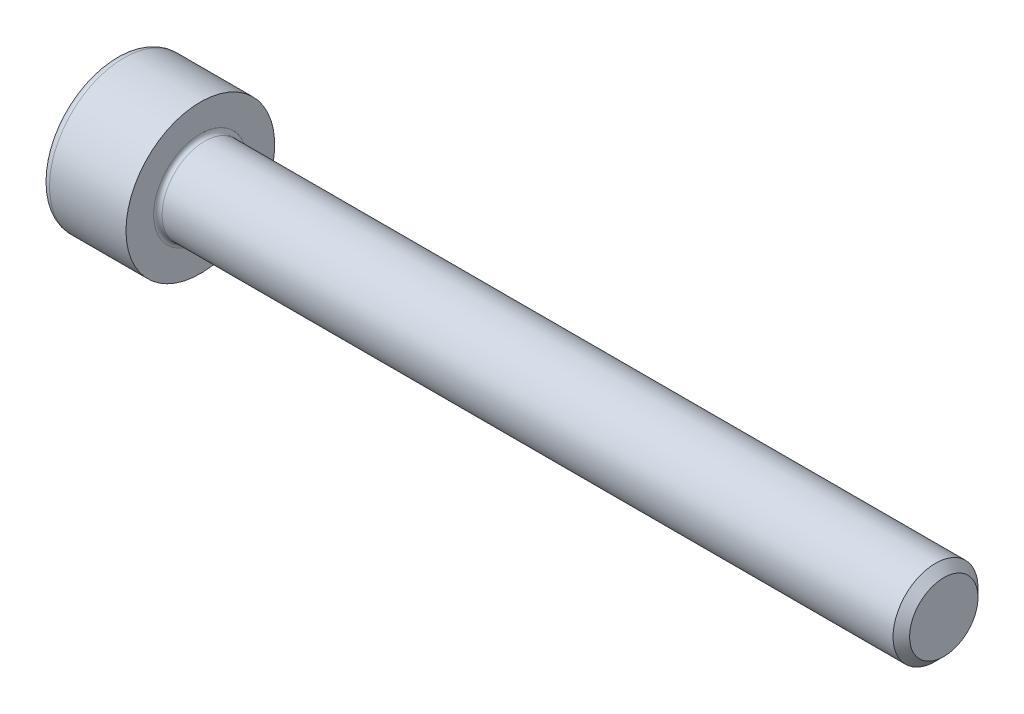
ISO-10303-21;
HEADER;
FILE_DESCRIPTION(('STEP AP214'),'2;1');
FILE_NAME('part.step','',(''),(''),'','','');
FILE_SCHEMA(('AUTOMOTIVE_DESIGN { 1 0 10303 214 1 1 1 1 }'));
ENDSEC;
DATA;
#1=APPLICATION_CONTEXT('core data for automotive mechanical design processes');
#2=APPLICATION_PROTOCOL_DEFINITION('international standard','automotive_design',2000,#1);
#3=PRODUCT_CONTEXT('',#1,'mechanical');
#4=PRODUCT('Part','Part','',(#3));
#5=PRODUCT_RELATED_PRODUCT_CATEGORY('part','',(#4));
#6=PRODUCT_DEFINITION_FORMATION('','',#4);
#7=PRODUCT_DEFINITION_CONTEXT('part definition',#1,'design');
#8=PRODUCT_DEFINITION('design','',#6,#7);
#9=PRODUCT_DEFINITION_SHAPE('','',#8);
#10=(LENGTH_UNIT() NAMED_UNIT(*) SI_UNIT(.MILLI.,.METRE.));
#11=(NAMED_UNIT(*) PLANE_ANGLE_UNIT() SI_UNIT($,.RADIAN.));
#12=(NAMED_UNIT(*) SI_UNIT($,.STERADIAN.) SOLID_ANGLE_UNIT());
#13=UNCERTAINTY_MEASURE_WITH_UNIT(LENGTH_MEASURE(1.E-05),#10,'distance_accuracy_value','');
#14=(GEOMETRIC_REPRESENTATION_CONTEXT(3) GLOBAL_UNCERTAINTY_ASSIGNED_CONTEXT((#13)) GLOBAL_UNIT_ASSIGNED_CONTEXT((#10,
#11,#12)) REPRESENTATION_CONTEXT('',''));
#15=CARTESIAN_POINT('',(0.,0.,0.));
#16=DIRECTION('',(0.,0.,1.));
#17=DIRECTION('',(1.,0.,0.));
#18=AXIS2_PLACEMENT_3D('',#15,#16,#17);
#19=CARTESIAN_POINT('',(0.,0.,0.));
#20=DIRECTION('',(-1.,0.,0.));
#21=DIRECTION('',(0.,0.,1.));
#22=AXIS2_PLACEMENT_3D('',#19,#20,#21);
#23=PLANE('',#22);
#24=DIRECTION('',(0.,-0.499999999999999,0.866025403784439));
#25=VECTOR('',#24,1.);
#26=CARTESIAN_POINT('',(0.,1.74359781295266,0.));
#27=LINE('',#26,#25);
#28=CARTESIAN_POINT('',(0.,1.74359781295266,0.));
#29=VERTEX_POINT('',#28);
#30=CARTESIAN_POINT('',(0.,0.871798906476331,1.51));
#31=VERTEX_POINT('',#30);
#32=EDGE_CURVE('E259',#29,#31,#27,.T.);
#33=ORIENTED_EDGE('',*,*,#32,.T.);
#34=DIRECTION('',(0.,1.,0.));
#35=VECTOR('',#34,1.);
#36=CARTESIAN_POINT('',(0.,-0.871798906476338,1.51));
#37=LINE('',#36,#35);
#38=CARTESIAN_POINT('',(0.,-0.871798906476338,1.51));
#39=VERTEX_POINT('',#38);
#40=EDGE_CURVE('E131',#39,#31,#37,.T.);
#41=ORIENTED_EDGE('',*,*,#40,.F.);
#42=DIRECTION('',(0.,-0.500000000000001,-0.866025403784438));
#43=VECTOR('',#42,1.);
#44=CARTESIAN_POINT('',(0.,-0.871798906476338,1.51));
#45=LINE('',#44,#43);
#46=CARTESIAN_POINT('',(0.,-1.74359781295268,0.));
#47=VERTEX_POINT('',#46);
#48=EDGE_CURVE('E262',#39,#47,#45,.T.);
#49=ORIENTED_EDGE('',*,*,#48,.T.);
#50=DIRECTION('',(0.,0.499999999999999,-0.86602540378444));
#51=VECTOR('',#50,1.);
#52=CARTESIAN_POINT('',(0.,-1.74359781295268,0.));
#53=LINE('',#52,#51);
#54=CARTESIAN_POINT('',(0.,-0.871798906476342,-1.51));
#55=VERTEX_POINT('',#54);
#56=EDGE_CURVE('E265',#47,#55,#53,.T.);
#57=ORIENTED_EDGE('',*,*,#56,.T.);
#58=DIRECTION('',(0.,-1.,0.));
#59=VECTOR('',#58,1.);
#60=CARTESIAN_POINT('',(0.,0.871798906476328,-1.51));
#61=LINE('',#60,#59);
#62=CARTESIAN_POINT('',(0.,0.871798906476328,-1.51));
#63=VERTEX_POINT('',#62);
#64=EDGE_CURVE('E268',#63,#55,#61,.T.);
#65=ORIENTED_EDGE('',*,*,#64,.F.);
#66=DIRECTION('',(0.,-0.500000000000001,-0.866025403784438));
#67=VECTOR('',#66,1.);
#68=CARTESIAN_POINT('',(0.,1.74359781295266,0.));
#69=LINE('',#68,#67);
#70=EDGE_CURVE('E126',#29,#63,#69,.T.);
#71=ORIENTED_EDGE('',*,*,#70,.F.);
#72=EDGE_LOOP('',(#33,#41,#49,#57,#65,#71));
#73=FACE_BOUND('',#72,.T.);
#74=CARTESIAN_POINT('',(0.,0.,0.));
#75=DIRECTION('',(-1.,0.,0.));
#76=DIRECTION('',(0.,0.,1.));
#77=AXIS2_PLACEMENT_3D('',#74,#75,#76);
#78=CIRCLE('',#77,3.1);
#79=CARTESIAN_POINT('',(0.,0.,3.1));
#80=VERTEX_POINT('',#79);
#81=EDGE_CURVE('E43',#80,#80,#78,.T.);
#82=ORIENTED_EDGE('',*,*,#81,.T.);
#83=EDGE_LOOP('',(#82));
#84=FACE_BOUND('',#83,.T.);
#85=ADVANCED_FACE('F35',(#73,#84),#23,.T.);
#86=CARTESIAN_POINT('',(-31.75,0.,0.));
#87=DIRECTION('',(-1.,0.,0.));
#88=DIRECTION('',(0.,0.,1.));
#89=AXIS2_PLACEMENT_3D('',#86,#87,#88);
#90=CYLINDRICAL_SURFACE('',#89,3.5);
#91=CARTESIAN_POINT('',(0.399999999999998,0.,0.));
#92=DIRECTION('',(-1.,0.,0.));
#93=DIRECTION('',(0.,0.,1.));
#94=AXIS2_PLACEMENT_3D('',#91,#92,#93);
#95=CIRCLE('',#94,3.5);
#96=CARTESIAN_POINT('',(0.399999999999998,0.,3.5));
#97=VERTEX_POINT('',#96);
#98=EDGE_CURVE('E11',#97,#97,#95,.F.);
#99=ORIENTED_EDGE('',*,*,#98,.T.);
#100=EDGE_LOOP('',(#99));
#101=FACE_BOUND('',#100,.T.);
#102=CARTESIAN_POINT('',(4.,0.,0.));
#103=DIRECTION('',(-1.,0.,0.));
#104=DIRECTION('',(0.,0.,1.));
#105=AXIS2_PLACEMENT_3D('',#102,#103,#104);
#106=CIRCLE('',#105,3.5);
#107=CARTESIAN_POINT('',(4.,0.,3.5));
#108=VERTEX_POINT('',#107);
#109=EDGE_CURVE('E149',#108,#108,#106,.T.);
#110=ORIENTED_EDGE('',*,*,#109,.T.);
#111=EDGE_LOOP('',(#110));
#112=FACE_BOUND('',#111,.T.);
#113=ADVANCED_FACE('F173',(#101,#112),#90,.T.);
#114=CARTESIAN_POINT('',(4.,3.5,0.));
#115=DIRECTION('',(1.,0.,0.));
#116=DIRECTION('',(0.,0.,-1.));
#117=AXIS2_PLACEMENT_3D('',#114,#115,#116);
#118=PLANE('',#117);
#119=CARTESIAN_POINT('',(4.,0.,0.));
#120=DIRECTION('',(1.,0.,0.));
#121=DIRECTION('',(0.,0.,-1.));
#122=AXIS2_PLACEMENT_3D('',#119,#120,#121);
#123=CIRCLE('',#122,2.19999999999999);
#124=CARTESIAN_POINT('',(4.,0.,-2.19999999999999));
#125=VERTEX_POINT('',#124);
#126=EDGE_CURVE('E152',#125,#125,#123,.F.);
#127=ORIENTED_EDGE('',*,*,#126,.T.);
#128=EDGE_LOOP('',(#127));
#129=FACE_BOUND('',#128,.T.);
#130=ORIENTED_EDGE('',*,*,#109,.F.);
#131=EDGE_LOOP('',(#130));
#132=FACE_BOUND('',#131,.T.);
#133=ADVANCED_FACE('F179',(#129,#132),#118,.T.);
#134=CARTESIAN_POINT('',(-31.75,0.,0.));
#135=DIRECTION('',(-1.,0.,0.));
#136=DIRECTION('',(0.,0.,1.));
#137=AXIS2_PLACEMENT_3D('',#134,#135,#136);
#138=CYLINDRICAL_SURFACE('',#137,1.99999999999999);
#139=CARTESIAN_POINT('',(4.2,0.,0.));
#140=DIRECTION('',(1.,0.,0.));
#141=DIRECTION('',(0.,0.,-1.));
#142=AXIS2_PLACEMENT_3D('',#139,#140,#141);
#143=CIRCLE('',#142,1.99999999999999);
#144=CARTESIAN_POINT('',(4.2,0.,-1.99999999999999));
#145=VERTEX_POINT('',#144);
#146=EDGE_CURVE('E155',#145,#145,#143,.T.);
#147=ORIENTED_EDGE('',*,*,#146,.T.);
#148=EDGE_LOOP('',(#147));
#149=FACE_BOUND('',#148,.T.);
#150=CARTESIAN_POINT('',(38.61,0.,0.));
#151=DIRECTION('',(-1.,0.,0.));
#152=DIRECTION('',(0.,0.,1.));
#153=AXIS2_PLACEMENT_3D('',#150,#151,#152);
#154=CIRCLE('',#153,1.99999999999998);
#155=CARTESIAN_POINT('',(38.61,0.,1.99999999999998));
#156=VERTEX_POINT('',#155);
#157=EDGE_CURVE('E146',#156,#156,#154,.T.);
#158=ORIENTED_EDGE('',*,*,#157,.T.);
#159=EDGE_LOOP('',(#158));
#160=FACE_BOUND('',#159,.T.);
#161=ADVANCED_FACE('F185',(#149,#160),#138,.T.);
#162=CARTESIAN_POINT('',(39.,0.,0.));
#163=DIRECTION('',(-1.,0.,0.));
#164=DIRECTION('',(0.,0.,1.));
#165=AXIS2_PLACEMENT_3D('',#162,#163,#164);
#166=CONICAL_SURFACE('',#165,1.61,0.7853981633974);
#167=ORIENTED_EDGE('',*,*,#157,.F.);
#168=EDGE_LOOP('',(#167));
#169=FACE_BOUND('',#168,.T.);
#170=CARTESIAN_POINT('',(39.,0.,0.));
#171=DIRECTION('',(-1.,0.,0.));
#172=DIRECTION('',(0.,0.,1.));
#173=AXIS2_PLACEMENT_3D('',#170,#171,#172);
#174=CIRCLE('',#173,1.61);
#175=CARTESIAN_POINT('',(39.,0.,1.61));
#176=VERTEX_POINT('',#175);
#177=EDGE_CURVE('E142',#176,#176,#174,.T.);
#178=ORIENTED_EDGE('',*,*,#177,.T.);
#179=EDGE_LOOP('',(#178));
#180=FACE_BOUND('',#179,.T.);
#181=ADVANCED_FACE('F189',(#169,#180),#166,.T.);
#182=CARTESIAN_POINT('',(39.,1.61,0.));
#183=DIRECTION('',(1.,0.,0.));
#184=DIRECTION('',(0.,0.,-1.));
#185=AXIS2_PLACEMENT_3D('',#182,#183,#184);
#186=PLANE('',#185);
#187=ORIENTED_EDGE('',*,*,#177,.F.);
#188=EDGE_LOOP('',(#187));
#189=FACE_BOUND('',#188,.T.);
#190=ADVANCED_FACE('F169',(#189),#186,.T.);
#191=CARTESIAN_POINT('',(4.2,0.,0.));
#192=DIRECTION('',(1.,0.,0.));
#193=DIRECTION('',(0.,0.,-1.));
#194=AXIS2_PLACEMENT_3D('',#191,#192,#193);
#195=TOROIDAL_SURFACE('',#194,2.19999999999999,0.2);
#196=ORIENTED_EDGE('',*,*,#146,.F.);
#197=EDGE_LOOP('',(#196));
#198=FACE_BOUND('',#197,.T.);
#199=ORIENTED_EDGE('',*,*,#126,.F.);
#200=EDGE_LOOP('',(#199));
#201=FACE_BOUND('',#200,.T.);
#202=ADVANCED_FACE('F162',(#198,#201),#195,.F.);
#203=CARTESIAN_POINT('',(0.399999999999998,0.,0.));
#204=DIRECTION('',(-1.,0.,0.));
#205=DIRECTION('',(0.,0.,1.));
#206=AXIS2_PLACEMENT_3D('',#203,#204,#205);
#207=TOROIDAL_SURFACE('',#206,3.1,0.4);
#208=ORIENTED_EDGE('',*,*,#98,.F.);
#209=EDGE_LOOP('',(#208));
#210=FACE_BOUND('',#209,.T.);
#211=ORIENTED_EDGE('',*,*,#81,.F.);
#212=EDGE_LOOP('',(#211));
#213=FACE_BOUND('',#212,.T.);
#214=ADVANCED_FACE('F37',(#210,#213),#207,.T.);
#215=CARTESIAN_POINT('',(2.,1.74359781295266,0.));
#216=DIRECTION('',(0.,-0.866025403784439,-0.499999999999999));
#217=DIRECTION('',(0.,0.499999999999999,-0.866025403784439));
#218=AXIS2_PLACEMENT_3D('',#215,#216,#217);
#219=PLANE('',#218);
#220=ORIENTED_EDGE('',*,*,#32,.F.);
#221=DIRECTION('',(-1.,0.,0.));
#222=VECTOR('',#221,1.);
#223=CARTESIAN_POINT('',(2.,1.74359781295266,0.));
#224=LINE('',#223,#222);
#225=CARTESIAN_POINT('',(2.,1.74359781295266,0.));
#226=VERTEX_POINT('',#225);
#227=EDGE_CURVE('E249',#226,#29,#224,.T.);
#228=ORIENTED_EDGE('',*,*,#227,.F.);
#229=DIRECTION('',(0.,-0.499999999999999,0.866025403784439));
#230=VECTOR('',#229,1.);
#231=CARTESIAN_POINT('',(2.,1.74359781295266,0.));
#232=LINE('',#231,#230);
#233=CARTESIAN_POINT('',(2.,1.3076983597145,0.754999999999996));
#234=VERTEX_POINT('',#233);
#235=EDGE_CURVE('E118',#226,#234,#232,.T.);
#236=ORIENTED_EDGE('',*,*,#235,.T.);
#237=CARTESIAN_POINT('',(2.,0.871798906476331,1.51));
#238=VERTEX_POINT('',#237);
#239=EDGE_CURVE('E109',#234,#238,#232,.T.);
#240=ORIENTED_EDGE('',*,*,#239,.T.);
#241=DIRECTION('',(-1.,0.,0.));
#242=VECTOR('',#241,1.);
#243=CARTESIAN_POINT('',(2.,0.871798906476331,1.51));
#244=LINE('',#243,#242);
#245=EDGE_CURVE('E123',#238,#31,#244,.T.);
#246=ORIENTED_EDGE('',*,*,#245,.T.);
#247=EDGE_LOOP('',(#220,#228,#236,#240,#246));
#248=FACE_BOUND('',#247,.T.);
#249=ADVANCED_FACE('F122',(#248),#219,.T.);
#250=CARTESIAN_POINT('',(2.,-0.871798906476338,1.51));
#251=DIRECTION('',(0.,0.,1.));
#252=DIRECTION('',(0.,-1.,0.));
#253=AXIS2_PLACEMENT_3D('',#250,#251,#252);
#254=PLANE('',#253);
#255=ORIENTED_EDGE('',*,*,#40,.T.);
#256=ORIENTED_EDGE('',*,*,#245,.F.);
#257=DIRECTION('',(0.,1.,0.));
#258=VECTOR('',#257,1.);
#259=CARTESIAN_POINT('',(2.,-0.871798906476338,1.51));
#260=LINE('',#259,#258);
#261=CARTESIAN_POINT('',(2.,0.,1.51));
#262=VERTEX_POINT('',#261);
#263=EDGE_CURVE('E106',#262,#238,#260,.T.);
#264=ORIENTED_EDGE('',*,*,#263,.F.);
#265=CARTESIAN_POINT('',(2.,-0.871798906476338,1.51));
#266=VERTEX_POINT('',#265);
#267=EDGE_CURVE('E117',#266,#262,#260,.T.);
#268=ORIENTED_EDGE('',*,*,#267,.F.);
#269=DIRECTION('',(-1.,0.,0.));
#270=VECTOR('',#269,1.);
#271=CARTESIAN_POINT('',(2.,-0.871798906476338,1.51));
#272=LINE('',#271,#270);
#273=EDGE_CURVE('E133',#266,#39,#272,.T.);
#274=ORIENTED_EDGE('',*,*,#273,.T.);
#275=EDGE_LOOP('',(#255,#256,#264,#268,#274));
#276=FACE_BOUND('',#275,.T.);
#277=ADVANCED_FACE('F128',(#276),#254,.F.);
#278=CARTESIAN_POINT('',(2.,-0.871798906476338,1.51));
#279=DIRECTION('',(0.,0.866025403784438,-0.500000000000001));
#280=DIRECTION('',(0.,0.500000000000001,0.866025403784438));
#281=AXIS2_PLACEMENT_3D('',#278,#279,#280);
#282=PLANE('',#281);
#283=ORIENTED_EDGE('',*,*,#48,.F.);
#284=ORIENTED_EDGE('',*,*,#273,.F.);
#285=DIRECTION('',(0.,-0.500000000000001,-0.866025403784438));
#286=VECTOR('',#285,1.);
#287=CARTESIAN_POINT('',(2.,-0.871798906476338,1.51));
#288=LINE('',#287,#286);
#289=CARTESIAN_POINT('',(2.,-1.3076983597145,0.755000000000003));
#290=VERTEX_POINT('',#289);
#291=EDGE_CURVE('E288',#266,#290,#288,.T.);
#292=ORIENTED_EDGE('',*,*,#291,.T.);
#293=CARTESIAN_POINT('',(2.,-1.74359781295268,0.));
#294=VERTEX_POINT('',#293);
#295=EDGE_CURVE('E277',#290,#294,#288,.T.);
#296=ORIENTED_EDGE('',*,*,#295,.T.);
#297=DIRECTION('',(-1.,0.,0.));
#298=VECTOR('',#297,1.);
#299=CARTESIAN_POINT('',(2.,-1.74359781295268,0.));
#300=LINE('',#299,#298);
#301=EDGE_CURVE('E138',#294,#47,#300,.T.);
#302=ORIENTED_EDGE('',*,*,#301,.T.);
#303=EDGE_LOOP('',(#283,#284,#292,#296,#302));
#304=FACE_BOUND('',#303,.T.);
#305=ADVANCED_FACE('F203',(#304),#282,.T.);
#306=CARTESIAN_POINT('',(2.,-1.74359781295268,0.));
#307=DIRECTION('',(0.,0.86602540378444,0.499999999999999));
#308=DIRECTION('',(0.,-0.499999999999999,0.86602540378444));
#309=AXIS2_PLACEMENT_3D('',#306,#307,#308);
#310=PLANE('',#309);
#311=ORIENTED_EDGE('',*,*,#56,.F.);
#312=ORIENTED_EDGE('',*,*,#301,.F.);
#313=DIRECTION('',(0.,0.499999999999999,-0.86602540378444));
#314=VECTOR('',#313,1.);
#315=CARTESIAN_POINT('',(2.,-1.74359781295268,0.));
#316=LINE('',#315,#314);
#317=CARTESIAN_POINT('',(2.,-1.30769835971451,-0.755000000000001));
#318=VERTEX_POINT('',#317);
#319=EDGE_CURVE('E255',#294,#318,#316,.T.);
#320=ORIENTED_EDGE('',*,*,#319,.T.);
#321=CARTESIAN_POINT('',(2.,-0.871798906476342,-1.51));
#322=VERTEX_POINT('',#321);
#323=EDGE_CURVE('E287',#318,#322,#316,.T.);
#324=ORIENTED_EDGE('',*,*,#323,.T.);
#325=DIRECTION('',(-1.,0.,0.));
#326=VECTOR('',#325,1.);
#327=CARTESIAN_POINT('',(2.,-0.871798906476342,-1.51));
#328=LINE('',#327,#326);
#329=EDGE_CURVE('E248',#322,#55,#328,.T.);
#330=ORIENTED_EDGE('',*,*,#329,.T.);
#331=EDGE_LOOP('',(#311,#312,#320,#324,#330));
#332=FACE_BOUND('',#331,.T.);
#333=ADVANCED_FACE('F206',(#332),#310,.T.);
#334=CARTESIAN_POINT('',(2.,0.871798906476328,-1.51));
#335=DIRECTION('',(0.,0.,-1.));
#336=DIRECTION('',(0.,1.,0.));
#337=AXIS2_PLACEMENT_3D('',#334,#335,#336);
#338=PLANE('',#337);
#339=ORIENTED_EDGE('',*,*,#64,.T.);
#340=ORIENTED_EDGE('',*,*,#329,.F.);
#341=DIRECTION('',(0.,-1.,0.));
#342=VECTOR('',#341,1.);
#343=CARTESIAN_POINT('',(2.,0.871798906476328,-1.51));
#344=LINE('',#343,#342);
#345=CARTESIAN_POINT('',(2.,0.,-1.51));
#346=VERTEX_POINT('',#345);
#347=EDGE_CURVE('E252',#346,#322,#344,.T.);
#348=ORIENTED_EDGE('',*,*,#347,.F.);
#349=CARTESIAN_POINT('',(2.,0.871798906476328,-1.51));
#350=VERTEX_POINT('',#349);
#351=EDGE_CURVE('E50',#350,#346,#344,.T.);
#352=ORIENTED_EDGE('',*,*,#351,.F.);
#353=DIRECTION('',(-1.,0.,0.));
#354=VECTOR('',#353,1.);
#355=CARTESIAN_POINT('',(2.,0.871798906476328,-1.51));
#356=LINE('',#355,#354);
#357=EDGE_CURVE('E245',#350,#63,#356,.T.);
#358=ORIENTED_EDGE('',*,*,#357,.T.);
#359=EDGE_LOOP('',(#339,#340,#348,#352,#358));
#360=FACE_BOUND('',#359,.T.);
#361=ADVANCED_FACE('F210',(#360),#338,.F.);
#362=CARTESIAN_POINT('',(2.,1.74359781295266,0.));
#363=DIRECTION('',(0.,0.866025403784438,-0.500000000000001));
#364=DIRECTION('',(0.,0.500000000000001,0.866025403784438));
#365=AXIS2_PLACEMENT_3D('',#362,#363,#364);
#366=PLANE('',#365);
#367=ORIENTED_EDGE('',*,*,#70,.T.);
#368=ORIENTED_EDGE('',*,*,#357,.F.);
#369=DIRECTION('',(0.,-0.500000000000001,-0.866025403784438));
#370=VECTOR('',#369,1.);
#371=CARTESIAN_POINT('',(2.,1.74359781295266,0.));
#372=LINE('',#371,#370);
#373=CARTESIAN_POINT('',(2.,1.3076983597145,-0.755));
#374=VERTEX_POINT('',#373);
#375=EDGE_CURVE('E235',#374,#350,#372,.T.);
#376=ORIENTED_EDGE('',*,*,#375,.F.);
#377=EDGE_CURVE('E241',#226,#374,#372,.T.);
#378=ORIENTED_EDGE('',*,*,#377,.F.);
#379=ORIENTED_EDGE('',*,*,#227,.T.);
#380=EDGE_LOOP('',(#367,#368,#376,#378,#379));
#381=FACE_BOUND('',#380,.T.);
#382=ADVANCED_FACE('F214',(#381),#366,.F.);
#383=CARTESIAN_POINT('',(2.,0.,3.02));
#384=DIRECTION('',(1.,0.,0.));
#385=DIRECTION('',(0.,0.,-1.));
#386=AXIS2_PLACEMENT_3D('',#383,#384,#385);
#387=PLANE('',#386);
#388=ORIENTED_EDGE('',*,*,#347,.T.);
#389=ORIENTED_EDGE('',*,*,#323,.F.);
#390=CARTESIAN_POINT('',(2.,0.,0.));
#391=DIRECTION('',(-1.,0.,0.));
#392=DIRECTION('',(0.,0.,1.));
#393=AXIS2_PLACEMENT_3D('',#390,#391,#392);
#394=CIRCLE('',#393,1.51);
#395=EDGE_CURVE('E283',#346,#318,#394,.T.);
#396=ORIENTED_EDGE('',*,*,#395,.F.);
#397=EDGE_LOOP('',(#388,#389,#396));
#398=FACE_BOUND('',#397,.T.);
#399=ADVANCED_FACE('F218',(#398),#387,.F.);
#400=ORIENTED_EDGE('',*,*,#319,.F.);
#401=ORIENTED_EDGE('',*,*,#295,.F.);
#402=EDGE_CURVE('E136',#318,#290,#394,.T.);
#403=ORIENTED_EDGE('',*,*,#402,.F.);
#404=EDGE_LOOP('',(#400,#401,#403));
#405=FACE_BOUND('',#404,.T.);
#406=ADVANCED_FACE('F221',(#405),#387,.F.);
#407=ORIENTED_EDGE('',*,*,#291,.F.);
#408=ORIENTED_EDGE('',*,*,#267,.T.);
#409=EDGE_CURVE('E132',#290,#262,#394,.T.);
#410=ORIENTED_EDGE('',*,*,#409,.F.);
#411=EDGE_LOOP('',(#407,#408,#410));
#412=FACE_BOUND('',#411,.T.);
#413=ADVANCED_FACE('F226',(#412),#387,.F.);
#414=ORIENTED_EDGE('',*,*,#263,.T.);
#415=ORIENTED_EDGE('',*,*,#239,.F.);
#416=EDGE_CURVE('E112',#262,#234,#394,.T.);
#417=ORIENTED_EDGE('',*,*,#416,.F.);
#418=EDGE_LOOP('',(#414,#415,#417));
#419=FACE_BOUND('',#418,.T.);
#420=ADVANCED_FACE('F108',(#419),#387,.F.);
#421=ORIENTED_EDGE('',*,*,#235,.F.);
#422=ORIENTED_EDGE('',*,*,#377,.T.);
#423=EDGE_CURVE('E143',#234,#374,#394,.T.);
#424=ORIENTED_EDGE('',*,*,#423,.F.);
#425=EDGE_LOOP('',(#421,#422,#424));
#426=FACE_BOUND('',#425,.T.);
#427=ADVANCED_FACE('F229',(#426),#387,.F.);
#428=ORIENTED_EDGE('',*,*,#375,.T.);
#429=ORIENTED_EDGE('',*,*,#351,.T.);
#430=EDGE_CURVE('E238',#374,#346,#394,.T.);
#431=ORIENTED_EDGE('',*,*,#430,.F.);
#432=EDGE_LOOP('',(#428,#429,#431));
#433=FACE_BOUND('',#432,.T.);
#434=ADVANCED_FACE('F199',(#433),#387,.F.);
#435=CARTESIAN_POINT('',(2.,0.,0.));
#436=DIRECTION('',(-1.,0.,0.));
#437=DIRECTION('',(0.,0.,1.));
#438=AXIS2_PLACEMENT_3D('',#435,#436,#437);
#439=CONICAL_SURFACE('',#438,1.51,1.04719755119659);
#440=CARTESIAN_POINT('',(2.87179890647635,0.,0.));
#441=VERTEX_POINT('',#440);
#442=VERTEX_LOOP('',#441);
#443=FACE_BOUND('',#442,.T.);
#444=ORIENTED_EDGE('',*,*,#416,.T.);
#445=ORIENTED_EDGE('',*,*,#423,.T.);
#446=ORIENTED_EDGE('',*,*,#430,.T.);
#447=ORIENTED_EDGE('',*,*,#395,.T.);
#448=ORIENTED_EDGE('',*,*,#402,.T.);
#449=ORIENTED_EDGE('',*,*,#409,.T.);
#450=EDGE_LOOP('',(#444,#445,#446,#447,#448,#449));
#451=FACE_BOUND('',#450,.T.);
#452=ADVANCED_FACE('F197',(#443,#451),#439,.F.);
#453=CLOSED_SHELL('',(#85,#113,#133,#161,#181,#190,#202,#214,#249,#277,#305,#333,#361,#382,#399,
#406,#413,#420,#427,#434,#452));
#454=MANIFOLD_SOLID_BREP('B2',#453);
#455=ADVANCED_BREP_SHAPE_REPRESENTATION('',(#18,#454),#14);
#456=SHAPE_DEFINITION_REPRESENTATION(#9,#455);
ENDSEC;
END-ISO-10303-21;
